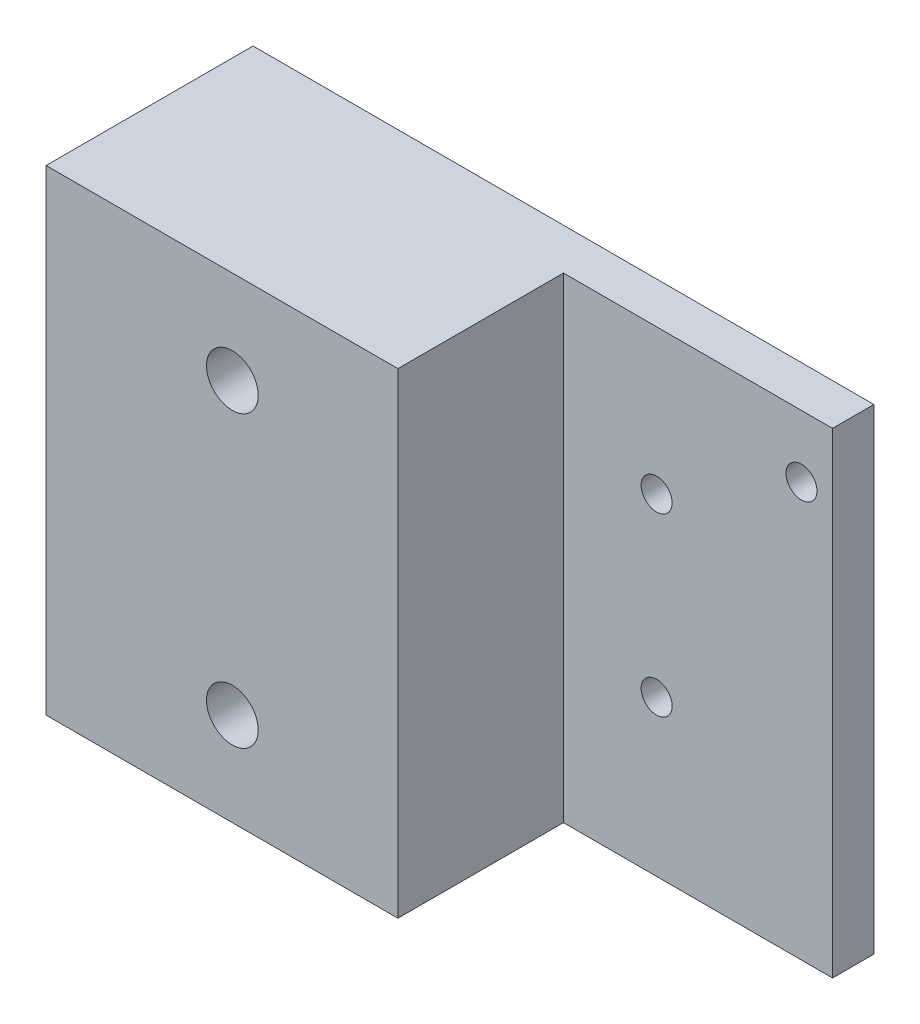
ISO-10303-21;
HEADER;
FILE_DESCRIPTION(('STEP AP214'),'2;1');
FILE_NAME('part.step','',(''),(''),'','','');
FILE_SCHEMA(('AUTOMOTIVE_DESIGN { 1 0 10303 214 1 1 1 1 }'));
ENDSEC;
DATA;
#1=APPLICATION_CONTEXT('core data for automotive mechanical design processes');
#2=APPLICATION_PROTOCOL_DEFINITION('international standard','automotive_design',2000,#1);
#3=PRODUCT_CONTEXT('',#1,'mechanical');
#4=PRODUCT('Part','Part','',(#3));
#5=PRODUCT_RELATED_PRODUCT_CATEGORY('part','',(#4));
#6=PRODUCT_DEFINITION_FORMATION('','',#4);
#7=PRODUCT_DEFINITION_CONTEXT('part definition',#1,'design');
#8=PRODUCT_DEFINITION('design','',#6,#7);
#9=PRODUCT_DEFINITION_SHAPE('','',#8);
#10=(LENGTH_UNIT() NAMED_UNIT(*) SI_UNIT(.MILLI.,.METRE.));
#11=(NAMED_UNIT(*) PLANE_ANGLE_UNIT() SI_UNIT($,.RADIAN.));
#12=(NAMED_UNIT(*) SI_UNIT($,.STERADIAN.) SOLID_ANGLE_UNIT());
#13=UNCERTAINTY_MEASURE_WITH_UNIT(LENGTH_MEASURE(1.E-05),#10,'distance_accuracy_value','');
#14=(GEOMETRIC_REPRESENTATION_CONTEXT(3) GLOBAL_UNCERTAINTY_ASSIGNED_CONTEXT((#13)) GLOBAL_UNIT_ASSIGNED_CONTEXT((#10,
#11,#12)) REPRESENTATION_CONTEXT('',''));
#15=CARTESIAN_POINT('',(0.,0.,0.));
#16=DIRECTION('',(0.,0.,1.));
#17=DIRECTION('',(1.,0.,0.));
#18=AXIS2_PLACEMENT_3D('',#15,#16,#17);
#19=CARTESIAN_POINT('',(-12.,14.,0.));
#20=DIRECTION('',(0.,0.,1.));
#21=DIRECTION('',(1.,0.,0.));
#22=AXIS2_PLACEMENT_3D('',#19,#20,#21);
#23=CYLINDRICAL_SURFACE('',#22,2.5);
#24=CARTESIAN_POINT('',(-12.,14.,20.));
#25=DIRECTION('',(0.,0.,1.));
#26=DIRECTION('',(1.,0.,0.));
#27=AXIS2_PLACEMENT_3D('',#24,#25,#26);
#28=CIRCLE('',#27,2.5);
#29=CARTESIAN_POINT('',(-9.50000000000002,14.,20.));
#30=VERTEX_POINT('',#29);
#31=EDGE_CURVE('E121',#30,#30,#28,.T.);
#32=ORIENTED_EDGE('',*,*,#31,.T.);
#33=EDGE_LOOP('',(#32));
#34=FACE_BOUND('',#33,.T.);
#35=CARTESIAN_POINT('',(-12.,14.,7.));
#36=DIRECTION('',(0.,0.,-1.));
#37=DIRECTION('',(-1.,0.,0.));
#38=AXIS2_PLACEMENT_3D('',#35,#36,#37);
#39=CIRCLE('',#38,2.5);
#40=CARTESIAN_POINT('',(-14.5,14.,7.));
#41=VERTEX_POINT('',#40);
#42=EDGE_CURVE('E38',#41,#41,#39,.F.);
#43=ORIENTED_EDGE('',*,*,#42,.F.);
#44=EDGE_LOOP('',(#43));
#45=FACE_BOUND('',#44,.T.);
#46=ADVANCED_FACE('F34',(#34,#45),#23,.F.);
#47=CARTESIAN_POINT('',(-12.,-14.,0.));
#48=DIRECTION('',(0.,0.,1.));
#49=DIRECTION('',(1.,0.,0.));
#50=AXIS2_PLACEMENT_3D('',#47,#48,#49);
#51=CYLINDRICAL_SURFACE('',#50,2.5);
#52=CARTESIAN_POINT('',(-12.,-14.,20.));
#53=DIRECTION('',(0.,0.,1.));
#54=DIRECTION('',(1.,0.,0.));
#55=AXIS2_PLACEMENT_3D('',#52,#53,#54);
#56=CIRCLE('',#55,2.5);
#57=CARTESIAN_POINT('',(-9.50000000000002,-14.,20.));
#58=VERTEX_POINT('',#57);
#59=EDGE_CURVE('E136',#58,#58,#56,.T.);
#60=ORIENTED_EDGE('',*,*,#59,.T.);
#61=EDGE_LOOP('',(#60));
#62=FACE_BOUND('',#61,.T.);
#63=CARTESIAN_POINT('',(-12.,-14.,7.));
#64=DIRECTION('',(0.,0.,-1.));
#65=DIRECTION('',(-1.,0.,0.));
#66=AXIS2_PLACEMENT_3D('',#63,#64,#65);
#67=CIRCLE('',#66,2.5);
#68=CARTESIAN_POINT('',(-14.5,-14.,7.));
#69=VERTEX_POINT('',#68);
#70=EDGE_CURVE('E115',#69,#69,#67,.F.);
#71=ORIENTED_EDGE('',*,*,#70,.F.);
#72=EDGE_LOOP('',(#71));
#73=FACE_BOUND('',#72,.T.);
#74=ADVANCED_FACE('F198',(#62,#73),#51,.F.);
#75=CARTESIAN_POINT('',(30.,23.,20.));
#76=DIRECTION('',(-1.,0.,0.));
#77=DIRECTION('',(0.,-1.,0.));
#78=AXIS2_PLACEMENT_3D('',#75,#76,#77);
#79=PLANE('',#78);
#80=DIRECTION('',(0.,1.,0.));
#81=VECTOR('',#80,1.);
#82=CARTESIAN_POINT('',(30.,-23.,4.));
#83=LINE('',#82,#81);
#84=CARTESIAN_POINT('',(30.,-23.,4.));
#85=VERTEX_POINT('',#84);
#86=CARTESIAN_POINT('',(30.,23.,4.));
#87=VERTEX_POINT('',#86);
#88=EDGE_CURVE('E85',#85,#87,#83,.T.);
#89=ORIENTED_EDGE('',*,*,#88,.F.);
#90=DIRECTION('',(0.,0.,-1.));
#91=VECTOR('',#90,1.);
#92=CARTESIAN_POINT('',(30.,-23.,20.));
#93=LINE('',#92,#91);
#94=CARTESIAN_POINT('',(30.,-23.,0.));
#95=VERTEX_POINT('',#94);
#96=EDGE_CURVE('E79',#85,#95,#93,.T.);
#97=ORIENTED_EDGE('',*,*,#96,.T.);
#98=DIRECTION('',(0.,1.,0.));
#99=VECTOR('',#98,1.);
#100=CARTESIAN_POINT('',(30.,23.,0.));
#101=LINE('',#100,#99);
#102=CARTESIAN_POINT('',(30.,23.,0.));
#103=VERTEX_POINT('',#102);
#104=EDGE_CURVE('E83',#95,#103,#101,.T.);
#105=ORIENTED_EDGE('',*,*,#104,.T.);
#106=DIRECTION('',(0.,0.,-1.));
#107=VECTOR('',#106,1.);
#108=CARTESIAN_POINT('',(30.,23.,20.));
#109=LINE('',#108,#107);
#110=EDGE_CURVE('E11',#87,#103,#109,.T.);
#111=ORIENTED_EDGE('',*,*,#110,.F.);
#112=EDGE_LOOP('',(#89,#97,#105,#111));
#113=FACE_BOUND('',#112,.T.);
#114=ADVANCED_FACE('F36',(#113),#79,.F.);
#115=CARTESIAN_POINT('',(-30.,23.,20.));
#116=DIRECTION('',(0.,-1.,0.));
#117=DIRECTION('',(0.,0.,-1.));
#118=AXIS2_PLACEMENT_3D('',#115,#116,#117);
#119=PLANE('',#118);
#120=DIRECTION('',(-1.,0.,0.));
#121=VECTOR('',#120,1.);
#122=CARTESIAN_POINT('',(-30.,23.,20.));
#123=LINE('',#122,#121);
#124=CARTESIAN_POINT('',(4.,23.,20.));
#125=VERTEX_POINT('',#124);
#126=CARTESIAN_POINT('',(-30.,23.,20.));
#127=VERTEX_POINT('',#126);
#128=EDGE_CURVE('E98',#125,#127,#123,.T.);
#129=ORIENTED_EDGE('',*,*,#128,.F.);
#130=DIRECTION('',(0.,0.,1.));
#131=VECTOR('',#130,1.);
#132=CARTESIAN_POINT('',(3.99999999999999,23.,4.));
#133=LINE('',#132,#131);
#134=CARTESIAN_POINT('',(3.99999999999999,23.,4.));
#135=VERTEX_POINT('',#134);
#136=EDGE_CURVE('E51',#135,#125,#133,.T.);
#137=ORIENTED_EDGE('',*,*,#136,.F.);
#138=DIRECTION('',(-1.,0.,0.));
#139=VECTOR('',#138,1.);
#140=CARTESIAN_POINT('',(30.,23.,4.));
#141=LINE('',#140,#139);
#142=EDGE_CURVE('E161',#87,#135,#141,.T.);
#143=ORIENTED_EDGE('',*,*,#142,.F.);
#144=ORIENTED_EDGE('',*,*,#110,.T.);
#145=DIRECTION('',(-1.,0.,0.));
#146=VECTOR('',#145,1.);
#147=CARTESIAN_POINT('',(-30.,23.,0.));
#148=LINE('',#147,#146);
#149=CARTESIAN_POINT('',(-30.,23.,0.));
#150=VERTEX_POINT('',#149);
#151=EDGE_CURVE('E103',#103,#150,#148,.T.);
#152=ORIENTED_EDGE('',*,*,#151,.T.);
#153=DIRECTION('',(0.,0.,-1.));
#154=VECTOR('',#153,1.);
#155=CARTESIAN_POINT('',(-30.,23.,20.));
#156=LINE('',#155,#154);
#157=EDGE_CURVE('E43',#127,#150,#156,.T.);
#158=ORIENTED_EDGE('',*,*,#157,.F.);
#159=EDGE_LOOP('',(#129,#137,#143,#144,#152,#158));
#160=FACE_BOUND('',#159,.T.);
#161=ADVANCED_FACE('F186',(#160),#119,.F.);
#162=CARTESIAN_POINT('',(-30.,23.,20.));
#163=DIRECTION('',(1.,0.,0.));
#164=DIRECTION('',(0.,1.,0.));
#165=AXIS2_PLACEMENT_3D('',#162,#163,#164);
#166=PLANE('',#165);
#167=DIRECTION('',(0.,-1.,0.));
#168=VECTOR('',#167,1.);
#169=CARTESIAN_POINT('',(-30.,23.,0.));
#170=LINE('',#169,#168);
#171=CARTESIAN_POINT('',(-30.,-23.,0.));
#172=VERTEX_POINT('',#171);
#173=EDGE_CURVE('E99',#150,#172,#170,.T.);
#174=ORIENTED_EDGE('',*,*,#173,.T.);
#175=DIRECTION('',(0.,0.,-1.));
#176=VECTOR('',#175,1.);
#177=CARTESIAN_POINT('',(-30.,-23.,20.));
#178=LINE('',#177,#176);
#179=CARTESIAN_POINT('',(-30.,-23.,20.));
#180=VERTEX_POINT('',#179);
#181=EDGE_CURVE('E88',#180,#172,#178,.T.);
#182=ORIENTED_EDGE('',*,*,#181,.F.);
#183=DIRECTION('',(0.,-1.,0.));
#184=VECTOR('',#183,1.);
#185=CARTESIAN_POINT('',(-30.,23.,20.));
#186=LINE('',#185,#184);
#187=EDGE_CURVE('E60',#127,#180,#186,.T.);
#188=ORIENTED_EDGE('',*,*,#187,.F.);
#189=ORIENTED_EDGE('',*,*,#157,.T.);
#190=EDGE_LOOP('',(#174,#182,#188,#189));
#191=FACE_BOUND('',#190,.T.);
#192=ADVANCED_FACE('F189',(#191),#166,.F.);
#193=CARTESIAN_POINT('',(-30.,-23.,20.));
#194=DIRECTION('',(0.,1.,0.));
#195=DIRECTION('',(0.,0.,1.));
#196=AXIS2_PLACEMENT_3D('',#193,#194,#195);
#197=PLANE('',#196);
#198=DIRECTION('',(1.,0.,0.));
#199=VECTOR('',#198,1.);
#200=CARTESIAN_POINT('',(30.,-23.,4.));
#201=LINE('',#200,#199);
#202=CARTESIAN_POINT('',(3.99999999999999,-23.,4.));
#203=VERTEX_POINT('',#202);
#204=EDGE_CURVE('E167',#203,#85,#201,.T.);
#205=ORIENTED_EDGE('',*,*,#204,.F.);
#206=DIRECTION('',(0.,0.,1.));
#207=VECTOR('',#206,1.);
#208=CARTESIAN_POINT('',(3.99999999999999,-23.,4.));
#209=LINE('',#208,#207);
#210=CARTESIAN_POINT('',(3.99999999999999,-23.,20.));
#211=VERTEX_POINT('',#210);
#212=EDGE_CURVE('E104',#203,#211,#209,.T.);
#213=ORIENTED_EDGE('',*,*,#212,.T.);
#214=DIRECTION('',(1.,0.,0.));
#215=VECTOR('',#214,1.);
#216=CARTESIAN_POINT('',(-30.,-23.,20.));
#217=LINE('',#216,#215);
#218=EDGE_CURVE('E89',#180,#211,#217,.T.);
#219=ORIENTED_EDGE('',*,*,#218,.F.);
#220=ORIENTED_EDGE('',*,*,#181,.T.);
#221=DIRECTION('',(1.,0.,0.));
#222=VECTOR('',#221,1.);
#223=CARTESIAN_POINT('',(-30.,-23.,0.));
#224=LINE('',#223,#222);
#225=EDGE_CURVE('E93',#172,#95,#224,.T.);
#226=ORIENTED_EDGE('',*,*,#225,.T.);
#227=ORIENTED_EDGE('',*,*,#96,.F.);
#228=EDGE_LOOP('',(#205,#213,#219,#220,#226,#227));
#229=FACE_BOUND('',#228,.T.);
#230=ADVANCED_FACE('F94',(#229),#197,.F.);
#231=CARTESIAN_POINT('',(0.,0.,20.));
#232=DIRECTION('',(0.,0.,1.));
#233=DIRECTION('',(1.,0.,0.));
#234=AXIS2_PLACEMENT_3D('',#231,#232,#233);
#235=PLANE('',#234);
#236=ORIENTED_EDGE('',*,*,#59,.F.);
#237=EDGE_LOOP('',(#236));
#238=FACE_BOUND('',#237,.T.);
#239=ORIENTED_EDGE('',*,*,#31,.F.);
#240=EDGE_LOOP('',(#239));
#241=FACE_BOUND('',#240,.T.);
#242=DIRECTION('',(0.,-1.,0.));
#243=VECTOR('',#242,1.);
#244=CARTESIAN_POINT('',(3.99999999999999,-23.,20.));
#245=LINE('',#244,#243);
#246=EDGE_CURVE('E157',#125,#211,#245,.T.);
#247=ORIENTED_EDGE('',*,*,#246,.F.);
#248=ORIENTED_EDGE('',*,*,#128,.T.);
#249=ORIENTED_EDGE('',*,*,#187,.T.);
#250=ORIENTED_EDGE('',*,*,#218,.T.);
#251=EDGE_LOOP('',(#247,#248,#249,#250));
#252=FACE_BOUND('',#251,.T.);
#253=ADVANCED_FACE('F173',(#238,#241,#252),#235,.T.);
#254=CARTESIAN_POINT('',(0.,0.,0.));
#255=DIRECTION('',(0.,0.,1.));
#256=DIRECTION('',(1.,0.,0.));
#257=AXIS2_PLACEMENT_3D('',#254,#255,#256);
#258=PLANE('',#257);
#259=CARTESIAN_POINT('',(-12.,-14.,0.));
#260=DIRECTION('',(0.,0.,-1.));
#261=DIRECTION('',(-1.,0.,0.));
#262=AXIS2_PLACEMENT_3D('',#259,#260,#261);
#263=CIRCLE('',#262,5.);
#264=CARTESIAN_POINT('',(-17.,-14.,0.));
#265=VERTEX_POINT('',#264);
#266=EDGE_CURVE('E123',#265,#265,#263,.T.);
#267=ORIENTED_EDGE('',*,*,#266,.F.);
#268=EDGE_LOOP('',(#267));
#269=FACE_BOUND('',#268,.T.);
#270=CARTESIAN_POINT('',(-12.,14.0825684826638,0.));
#271=DIRECTION('',(0.,0.,-1.));
#272=DIRECTION('',(-1.,0.,0.));
#273=AXIS2_PLACEMENT_3D('',#270,#271,#272);
#274=CIRCLE('',#273,5.);
#275=CARTESIAN_POINT('',(-17.,14.0825684826638,0.));
#276=VERTEX_POINT('',#275);
#277=EDGE_CURVE('E133',#276,#276,#274,.T.);
#278=ORIENTED_EDGE('',*,*,#277,.F.);
#279=EDGE_LOOP('',(#278));
#280=FACE_BOUND('',#279,.T.);
#281=CARTESIAN_POINT('',(27.,17.,0.));
#282=DIRECTION('',(0.,0.,1.));
#283=DIRECTION('',(1.,0.,0.));
#284=AXIS2_PLACEMENT_3D('',#281,#282,#283);
#285=CIRCLE('',#284,1.5);
#286=CARTESIAN_POINT('',(28.5,17.,0.));
#287=VERTEX_POINT('',#286);
#288=EDGE_CURVE('E149',#287,#287,#285,.T.);
#289=ORIENTED_EDGE('',*,*,#288,.T.);
#290=EDGE_LOOP('',(#289));
#291=FACE_BOUND('',#290,.T.);
#292=CARTESIAN_POINT('',(13.,-8.,0.));
#293=DIRECTION('',(0.,0.,1.));
#294=DIRECTION('',(1.,0.,0.));
#295=AXIS2_PLACEMENT_3D('',#292,#293,#294);
#296=CIRCLE('',#295,1.5);
#297=CARTESIAN_POINT('',(14.5,-8.,0.));
#298=VERTEX_POINT('',#297);
#299=EDGE_CURVE('E142',#298,#298,#296,.T.);
#300=ORIENTED_EDGE('',*,*,#299,.T.);
#301=EDGE_LOOP('',(#300));
#302=FACE_BOUND('',#301,.T.);
#303=CARTESIAN_POINT('',(13.,9.,0.));
#304=DIRECTION('',(0.,0.,1.));
#305=DIRECTION('',(1.,0.,0.));
#306=AXIS2_PLACEMENT_3D('',#303,#304,#305);
#307=CIRCLE('',#306,1.5);
#308=CARTESIAN_POINT('',(14.5,9.,0.));
#309=VERTEX_POINT('',#308);
#310=EDGE_CURVE('E154',#309,#309,#307,.T.);
#311=ORIENTED_EDGE('',*,*,#310,.T.);
#312=EDGE_LOOP('',(#311));
#313=FACE_BOUND('',#312,.T.);
#314=ORIENTED_EDGE('',*,*,#104,.F.);
#315=ORIENTED_EDGE('',*,*,#225,.F.);
#316=ORIENTED_EDGE('',*,*,#173,.F.);
#317=ORIENTED_EDGE('',*,*,#151,.F.);
#318=EDGE_LOOP('',(#314,#315,#316,#317));
#319=FACE_BOUND('',#318,.T.);
#320=ADVANCED_FACE('F102',(#269,#280,#291,#302,#313,#319),#258,.F.);
#321=CARTESIAN_POINT('',(3.99999999999999,-23.,4.));
#322=DIRECTION('',(-1.,0.,0.));
#323=DIRECTION('',(0.,0.,1.));
#324=AXIS2_PLACEMENT_3D('',#321,#322,#323);
#325=PLANE('',#324);
#326=ORIENTED_EDGE('',*,*,#246,.T.);
#327=ORIENTED_EDGE('',*,*,#212,.F.);
#328=DIRECTION('',(0.,-1.,0.));
#329=VECTOR('',#328,1.);
#330=CARTESIAN_POINT('',(3.99999999999999,-23.,4.));
#331=LINE('',#330,#329);
#332=EDGE_CURVE('E164',#135,#203,#331,.T.);
#333=ORIENTED_EDGE('',*,*,#332,.F.);
#334=ORIENTED_EDGE('',*,*,#136,.T.);
#335=EDGE_LOOP('',(#326,#327,#333,#334));
#336=FACE_BOUND('',#335,.T.);
#337=ADVANCED_FACE('F178',(#336),#325,.F.);
#338=CARTESIAN_POINT('',(0.,0.,4.));
#339=DIRECTION('',(0.,0.,1.));
#340=DIRECTION('',(1.,0.,0.));
#341=AXIS2_PLACEMENT_3D('',#338,#339,#340);
#342=PLANE('',#341);
#343=CARTESIAN_POINT('',(27.,17.,4.));
#344=DIRECTION('',(0.,0.,1.));
#345=DIRECTION('',(1.,0.,0.));
#346=AXIS2_PLACEMENT_3D('',#343,#344,#345);
#347=CIRCLE('',#346,1.5);
#348=CARTESIAN_POINT('',(28.5,17.,4.));
#349=VERTEX_POINT('',#348);
#350=EDGE_CURVE('E139',#349,#349,#347,.T.);
#351=ORIENTED_EDGE('',*,*,#350,.F.);
#352=EDGE_LOOP('',(#351));
#353=FACE_BOUND('',#352,.T.);
#354=CARTESIAN_POINT('',(13.,-8.,4.));
#355=DIRECTION('',(0.,0.,1.));
#356=DIRECTION('',(1.,0.,0.));
#357=AXIS2_PLACEMENT_3D('',#354,#355,#356);
#358=CIRCLE('',#357,1.5);
#359=CARTESIAN_POINT('',(14.5,-8.,4.));
#360=VERTEX_POINT('',#359);
#361=EDGE_CURVE('E146',#360,#360,#358,.T.);
#362=ORIENTED_EDGE('',*,*,#361,.F.);
#363=EDGE_LOOP('',(#362));
#364=FACE_BOUND('',#363,.T.);
#365=CARTESIAN_POINT('',(13.,9.,4.));
#366=DIRECTION('',(0.,0.,1.));
#367=DIRECTION('',(1.,0.,0.));
#368=AXIS2_PLACEMENT_3D('',#365,#366,#367);
#369=CIRCLE('',#368,1.5);
#370=CARTESIAN_POINT('',(14.5,9.,4.));
#371=VERTEX_POINT('',#370);
#372=EDGE_CURVE('E145',#371,#371,#369,.T.);
#373=ORIENTED_EDGE('',*,*,#372,.F.);
#374=EDGE_LOOP('',(#373));
#375=FACE_BOUND('',#374,.T.);
#376=ORIENTED_EDGE('',*,*,#88,.T.);
#377=ORIENTED_EDGE('',*,*,#142,.T.);
#378=ORIENTED_EDGE('',*,*,#332,.T.);
#379=ORIENTED_EDGE('',*,*,#204,.T.);
#380=EDGE_LOOP('',(#376,#377,#378,#379));
#381=FACE_BOUND('',#380,.T.);
#382=ADVANCED_FACE('F182',(#353,#364,#375,#381),#342,.T.);
#383=CARTESIAN_POINT('',(13.,9.,0.));
#384=DIRECTION('',(0.,0.,1.));
#385=DIRECTION('',(1.,0.,0.));
#386=AXIS2_PLACEMENT_3D('',#383,#384,#385);
#387=CYLINDRICAL_SURFACE('',#386,1.5);
#388=ORIENTED_EDGE('',*,*,#310,.F.);
#389=EDGE_LOOP('',(#388));
#390=FACE_BOUND('',#389,.T.);
#391=ORIENTED_EDGE('',*,*,#372,.T.);
#392=EDGE_LOOP('',(#391));
#393=FACE_BOUND('',#392,.T.);
#394=ADVANCED_FACE('F213',(#390,#393),#387,.F.);
#395=CARTESIAN_POINT('',(13.,-8.,0.));
#396=DIRECTION('',(0.,0.,1.));
#397=DIRECTION('',(1.,0.,0.));
#398=AXIS2_PLACEMENT_3D('',#395,#396,#397);
#399=CYLINDRICAL_SURFACE('',#398,1.5);
#400=ORIENTED_EDGE('',*,*,#299,.F.);
#401=EDGE_LOOP('',(#400));
#402=FACE_BOUND('',#401,.T.);
#403=ORIENTED_EDGE('',*,*,#361,.T.);
#404=EDGE_LOOP('',(#403));
#405=FACE_BOUND('',#404,.T.);
#406=ADVANCED_FACE('F209',(#402,#405),#399,.F.);
#407=CARTESIAN_POINT('',(27.,17.,0.));
#408=DIRECTION('',(0.,0.,1.));
#409=DIRECTION('',(1.,0.,0.));
#410=AXIS2_PLACEMENT_3D('',#407,#408,#409);
#411=CYLINDRICAL_SURFACE('',#410,1.5);
#412=ORIENTED_EDGE('',*,*,#288,.F.);
#413=EDGE_LOOP('',(#412));
#414=FACE_BOUND('',#413,.T.);
#415=ORIENTED_EDGE('',*,*,#350,.T.);
#416=EDGE_LOOP('',(#415));
#417=FACE_BOUND('',#416,.T.);
#418=ADVANCED_FACE('F212',(#414,#417),#411,.F.);
#419=CARTESIAN_POINT('',(-12.,-14.,7.));
#420=DIRECTION('',(0.,0.,-1.));
#421=DIRECTION('',(-1.,0.,0.));
#422=AXIS2_PLACEMENT_3D('',#419,#420,#421);
#423=PLANE('',#422);
#424=CARTESIAN_POINT('',(-12.,-14.,7.));
#425=DIRECTION('',(0.,0.,-1.));
#426=DIRECTION('',(-1.,0.,0.));
#427=AXIS2_PLACEMENT_3D('',#424,#425,#426);
#428=CIRCLE('',#427,5.);
#429=CARTESIAN_POINT('',(-17.,-14.,7.));
#430=VERTEX_POINT('',#429);
#431=EDGE_CURVE('E117',#430,#430,#428,.T.);
#432=ORIENTED_EDGE('',*,*,#431,.T.);
#433=EDGE_LOOP('',(#432));
#434=FACE_BOUND('',#433,.T.);
#435=ORIENTED_EDGE('',*,*,#70,.T.);
#436=EDGE_LOOP('',(#435));
#437=FACE_BOUND('',#436,.T.);
#438=ADVANCED_FACE('F217',(#434,#437),#423,.T.);
#439=CARTESIAN_POINT('',(-12.,-14.,7.));
#440=DIRECTION('',(0.,0.,-1.));
#441=DIRECTION('',(-1.,0.,0.));
#442=AXIS2_PLACEMENT_3D('',#439,#440,#441);
#443=CYLINDRICAL_SURFACE('',#442,5.);
#444=ORIENTED_EDGE('',*,*,#431,.F.);
#445=EDGE_LOOP('',(#444));
#446=FACE_BOUND('',#445,.T.);
#447=ORIENTED_EDGE('',*,*,#266,.T.);
#448=EDGE_LOOP('',(#447));
#449=FACE_BOUND('',#448,.T.);
#450=ADVANCED_FACE('F259',(#446,#449),#443,.F.);
#451=CARTESIAN_POINT('',(-12.,14.0825684826638,7.));
#452=DIRECTION('',(0.,0.,-1.));
#453=DIRECTION('',(-1.,0.,0.));
#454=AXIS2_PLACEMENT_3D('',#451,#452,#453);
#455=PLANE('',#454);
#456=CARTESIAN_POINT('',(-12.,14.0825684826638,7.));
#457=DIRECTION('',(0.,0.,-1.));
#458=DIRECTION('',(-1.,0.,0.));
#459=AXIS2_PLACEMENT_3D('',#456,#457,#458);
#460=CIRCLE('',#459,5.);
#461=CARTESIAN_POINT('',(-17.,14.0825684826638,7.));
#462=VERTEX_POINT('',#461);
#463=EDGE_CURVE('E128',#462,#462,#460,.T.);
#464=ORIENTED_EDGE('',*,*,#463,.T.);
#465=EDGE_LOOP('',(#464));
#466=FACE_BOUND('',#465,.T.);
#467=ORIENTED_EDGE('',*,*,#42,.T.);
#468=EDGE_LOOP('',(#467));
#469=FACE_BOUND('',#468,.T.);
#470=ADVANCED_FACE('F254',(#466,#469),#455,.T.);
#471=CARTESIAN_POINT('',(-12.,14.0825684826638,7.));
#472=DIRECTION('',(0.,0.,-1.));
#473=DIRECTION('',(-1.,0.,0.));
#474=AXIS2_PLACEMENT_3D('',#471,#472,#473);
#475=CYLINDRICAL_SURFACE('',#474,5.);
#476=ORIENTED_EDGE('',*,*,#463,.F.);
#477=EDGE_LOOP('',(#476));
#478=FACE_BOUND('',#477,.T.);
#479=ORIENTED_EDGE('',*,*,#277,.T.);
#480=EDGE_LOOP('',(#479));
#481=FACE_BOUND('',#480,.T.);
#482=ADVANCED_FACE('F252',(#478,#481),#475,.F.);
#483=CLOSED_SHELL('',(#46,#74,#114,#161,#192,#230,#253,#320,#337,#382,#394,#406,#418,#438,#450,
#470,#482));
#484=MANIFOLD_SOLID_BREP('B2',#483);
#485=ADVANCED_BREP_SHAPE_REPRESENTATION('',(#18,#484),#14);
#486=SHAPE_DEFINITION_REPRESENTATION(#9,#485);
ENDSEC;
END-ISO-10303-21;
